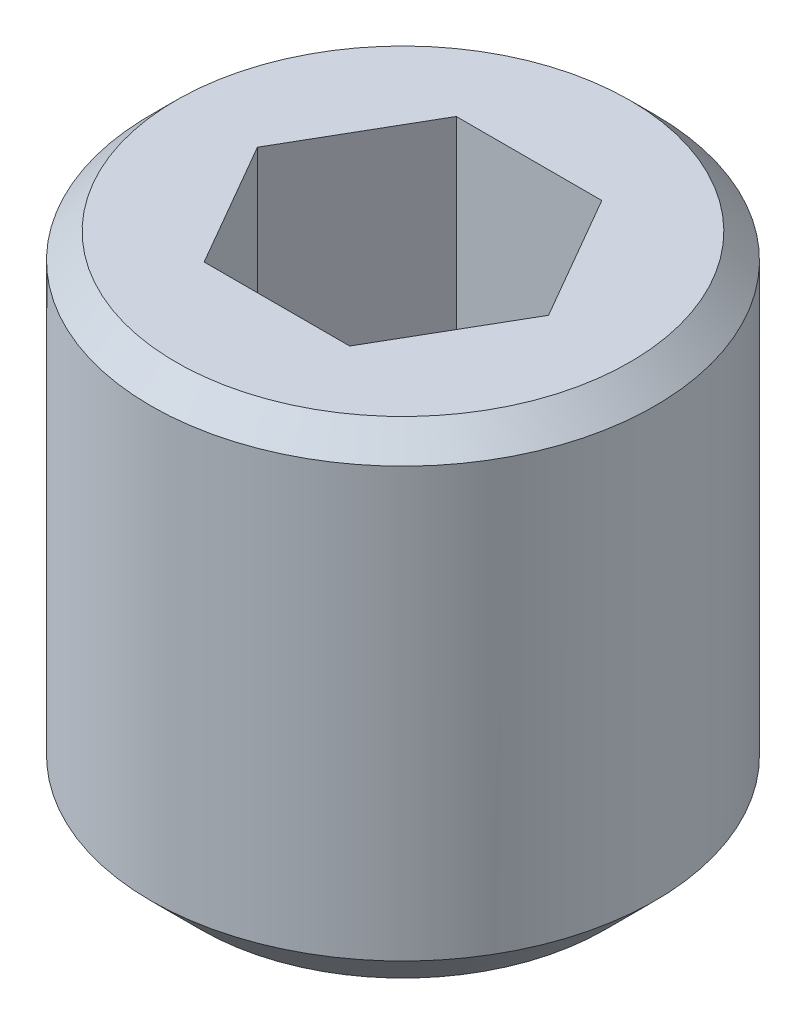
ISO-10303-21;
HEADER;
FILE_DESCRIPTION(('STEP AP214'),'2;1');
FILE_NAME('part.step','',(''),(''),'','','');
FILE_SCHEMA(('AUTOMOTIVE_DESIGN { 1 0 10303 214 1 1 1 1 }'));
ENDSEC;
DATA;
#1=APPLICATION_CONTEXT('core data for automotive mechanical design processes');
#2=APPLICATION_PROTOCOL_DEFINITION('international standard','automotive_design',2000,#1);
#3=PRODUCT_CONTEXT('',#1,'mechanical');
#4=PRODUCT('Part','Part','',(#3));
#5=PRODUCT_RELATED_PRODUCT_CATEGORY('part','',(#4));
#6=PRODUCT_DEFINITION_FORMATION('','',#4);
#7=PRODUCT_DEFINITION_CONTEXT('part definition',#1,'design');
#8=PRODUCT_DEFINITION('design','',#6,#7);
#9=PRODUCT_DEFINITION_SHAPE('','',#8);
#10=(LENGTH_UNIT() NAMED_UNIT(*) SI_UNIT(.MILLI.,.METRE.));
#11=(NAMED_UNIT(*) PLANE_ANGLE_UNIT() SI_UNIT($,.RADIAN.));
#12=(NAMED_UNIT(*) SI_UNIT($,.STERADIAN.) SOLID_ANGLE_UNIT());
#13=UNCERTAINTY_MEASURE_WITH_UNIT(LENGTH_MEASURE(1.E-05),#10,'distance_accuracy_value','');
#14=(GEOMETRIC_REPRESENTATION_CONTEXT(3) GLOBAL_UNCERTAINTY_ASSIGNED_CONTEXT((#13)) GLOBAL_UNIT_ASSIGNED_CONTEXT((#10,
#11,#12)) REPRESENTATION_CONTEXT('',''));
#15=CARTESIAN_POINT('',(0.,0.,0.));
#16=DIRECTION('',(0.,0.,1.));
#17=DIRECTION('',(1.,0.,0.));
#18=AXIS2_PLACEMENT_3D('',#15,#16,#17);
#19=CARTESIAN_POINT('',(0.,0.,0.));
#20=DIRECTION('',(0.,-1.,0.));
#21=DIRECTION('',(0.,0.,-1.));
#22=AXIS2_PLACEMENT_3D('',#19,#20,#21);
#23=PLANE('',#22);
#24=CARTESIAN_POINT('',(0.,0.,0.));
#25=DIRECTION('',(0.,-1.,0.));
#26=DIRECTION('',(0.,0.,-1.));
#27=AXIS2_PLACEMENT_3D('',#24,#25,#26);
#28=CIRCLE('',#27,1.35);
#29=CARTESIAN_POINT('',(0.,0.,-1.35));
#30=VERTEX_POINT('',#29);
#31=EDGE_CURVE('E45',#30,#30,#28,.F.);
#32=ORIENTED_EDGE('',*,*,#31,.T.);
#33=EDGE_LOOP('',(#32));
#34=FACE_BOUND('',#33,.T.);
#35=DIRECTION('',(-0.5,0.,0.866025403784439));
#36=VECTOR('',#35,1.);
#37=CARTESIAN_POINT('',(-0.43301270189222,0.,-0.75));
#38=LINE('',#37,#36);
#39=CARTESIAN_POINT('',(-0.43301270189222,0.,-0.75));
#40=VERTEX_POINT('',#39);
#41=CARTESIAN_POINT('',(-0.866025403784439,0.,0.));
#42=VERTEX_POINT('',#41);
#43=EDGE_CURVE('E126',#40,#42,#38,.T.);
#44=ORIENTED_EDGE('',*,*,#43,.F.);
#45=DIRECTION('',(-1.,0.,0.));
#46=VECTOR('',#45,1.);
#47=CARTESIAN_POINT('',(0.43301270189222,0.,-0.75));
#48=LINE('',#47,#46);
#49=CARTESIAN_POINT('',(0.43301270189222,0.,-0.75));
#50=VERTEX_POINT('',#49);
#51=EDGE_CURVE('E52',#50,#40,#48,.T.);
#52=ORIENTED_EDGE('',*,*,#51,.F.);
#53=DIRECTION('',(-0.5,0.,-0.866025403784439));
#54=VECTOR('',#53,1.);
#55=CARTESIAN_POINT('',(0.866025403784439,0.,0.));
#56=LINE('',#55,#54);
#57=CARTESIAN_POINT('',(0.866025403784439,0.,0.));
#58=VERTEX_POINT('',#57);
#59=EDGE_CURVE('E135',#58,#50,#56,.T.);
#60=ORIENTED_EDGE('',*,*,#59,.F.);
#61=DIRECTION('',(0.5,0.,-0.866025403784439));
#62=VECTOR('',#61,1.);
#63=CARTESIAN_POINT('',(0.43301270189222,0.,0.75));
#64=LINE('',#63,#62);
#65=CARTESIAN_POINT('',(0.43301270189222,0.,0.75));
#66=VERTEX_POINT('',#65);
#67=EDGE_CURVE('E133',#66,#58,#64,.T.);
#68=ORIENTED_EDGE('',*,*,#67,.F.);
#69=DIRECTION('',(1.,0.,0.));
#70=VECTOR('',#69,1.);
#71=CARTESIAN_POINT('',(-0.433012701892219,0.,0.750000000000001));
#72=LINE('',#71,#70);
#73=CARTESIAN_POINT('',(-0.433012701892219,0.,0.750000000000001));
#74=VERTEX_POINT('',#73);
#75=EDGE_CURVE('E100',#74,#66,#72,.T.);
#76=ORIENTED_EDGE('',*,*,#75,.F.);
#77=DIRECTION('',(0.5,0.,0.866025403784438));
#78=VECTOR('',#77,1.);
#79=CARTESIAN_POINT('',(-0.866025403784439,0.,0.));
#80=LINE('',#79,#78);
#81=EDGE_CURVE('E129',#42,#74,#80,.T.);
#82=ORIENTED_EDGE('',*,*,#81,.F.);
#83=EDGE_LOOP('',(#44,#52,#60,#68,#76,#82));
#84=FACE_BOUND('',#83,.T.);
#85=ADVANCED_FACE('F37',(#34,#84),#23,.F.);
#86=CARTESIAN_POINT('',(0.,0.,0.));
#87=DIRECTION('',(0.,1.,0.));
#88=DIRECTION('',(0.,0.,1.));
#89=AXIS2_PLACEMENT_3D('',#86,#87,#88);
#90=CYLINDRICAL_SURFACE('',#89,1.5);
#91=CARTESIAN_POINT('',(0.,-0.150000000000001,0.));
#92=DIRECTION('',(0.,-1.,0.));
#93=DIRECTION('',(0.,0.,-1.));
#94=AXIS2_PLACEMENT_3D('',#91,#92,#93);
#95=CIRCLE('',#94,1.5);
#96=CARTESIAN_POINT('',(0.,-0.150000000000001,-1.5));
#97=VERTEX_POINT('',#96);
#98=EDGE_CURVE('E11',#97,#97,#95,.T.);
#99=ORIENTED_EDGE('',*,*,#98,.T.);
#100=EDGE_LOOP('',(#99));
#101=FACE_BOUND('',#100,.T.);
#102=CARTESIAN_POINT('',(0.,-2.7,0.));
#103=DIRECTION('',(0.,1.,0.));
#104=DIRECTION('',(0.,0.,1.));
#105=AXIS2_PLACEMENT_3D('',#102,#103,#104);
#106=CIRCLE('',#105,1.5);
#107=CARTESIAN_POINT('',(0.,-2.7,1.5));
#108=VERTEX_POINT('',#107);
#109=EDGE_CURVE('E139',#108,#108,#106,.T.);
#110=ORIENTED_EDGE('',*,*,#109,.T.);
#111=EDGE_LOOP('',(#110));
#112=FACE_BOUND('',#111,.T.);
#113=ADVANCED_FACE('F163',(#101,#112),#90,.T.);
#114=CARTESIAN_POINT('',(1.5,-3.,0.));
#115=DIRECTION('',(0.,1.,0.));
#116=DIRECTION('',(0.,0.,1.));
#117=AXIS2_PLACEMENT_3D('',#114,#115,#116);
#118=PLANE('',#117);
#119=CARTESIAN_POINT('',(0.,-3.,0.));
#120=DIRECTION('',(0.,1.,0.));
#121=DIRECTION('',(0.,0.,1.));
#122=AXIS2_PLACEMENT_3D('',#119,#120,#121);
#123=CIRCLE('',#122,1.2);
#124=CARTESIAN_POINT('',(0.,-3.,1.2));
#125=VERTEX_POINT('',#124);
#126=EDGE_CURVE('E147',#125,#125,#123,.F.);
#127=ORIENTED_EDGE('',*,*,#126,.T.);
#128=EDGE_LOOP('',(#127));
#129=FACE_BOUND('',#128,.T.);
#130=ADVANCED_FACE('F168',(#129),#118,.F.);
#131=CARTESIAN_POINT('',(0.43301270189222,-1.5,-0.75));
#132=DIRECTION('',(0.,0.,-1.));
#133=DIRECTION('',(-1.,0.,0.));
#134=AXIS2_PLACEMENT_3D('',#131,#132,#133);
#135=PLANE('',#134);
#136=ORIENTED_EDGE('',*,*,#51,.T.);
#137=DIRECTION('',(0.,1.,0.));
#138=VECTOR('',#137,1.);
#139=CARTESIAN_POINT('',(-0.43301270189222,-1.5,-0.75));
#140=LINE('',#139,#138);
#141=CARTESIAN_POINT('',(-0.43301270189222,-1.5,-0.75));
#142=VERTEX_POINT('',#141);
#143=EDGE_CURVE('E82',#142,#40,#140,.T.);
#144=ORIENTED_EDGE('',*,*,#143,.F.);
#145=DIRECTION('',(-1.,0.,0.));
#146=VECTOR('',#145,1.);
#147=CARTESIAN_POINT('',(0.43301270189222,-1.5,-0.75));
#148=LINE('',#147,#146);
#149=CARTESIAN_POINT('',(0.43301270189222,-1.5,-0.75));
#150=VERTEX_POINT('',#149);
#151=EDGE_CURVE('E137',#150,#142,#148,.T.);
#152=ORIENTED_EDGE('',*,*,#151,.F.);
#153=DIRECTION('',(0.,1.,0.));
#154=VECTOR('',#153,1.);
#155=CARTESIAN_POINT('',(0.43301270189222,-1.5,-0.75));
#156=LINE('',#155,#154);
#157=EDGE_CURVE('E60',#150,#50,#156,.T.);
#158=ORIENTED_EDGE('',*,*,#157,.T.);
#159=EDGE_LOOP('',(#136,#144,#152,#158));
#160=FACE_BOUND('',#159,.T.);
#161=ADVANCED_FACE('F174',(#160),#135,.F.);
#162=CARTESIAN_POINT('',(0.866025403784439,-1.5,0.));
#163=DIRECTION('',(0.866025403784439,0.,-0.5));
#164=DIRECTION('',(-0.5,0.,-0.866025403784439));
#165=AXIS2_PLACEMENT_3D('',#162,#163,#164);
#166=PLANE('',#165);
#167=ORIENTED_EDGE('',*,*,#59,.T.);
#168=ORIENTED_EDGE('',*,*,#157,.F.);
#169=DIRECTION('',(-0.5,0.,-0.866025403784439));
#170=VECTOR('',#169,1.);
#171=CARTESIAN_POINT('',(0.866025403784439,-1.5,0.));
#172=LINE('',#171,#170);
#173=CARTESIAN_POINT('',(0.866025403784439,-1.5,0.));
#174=VERTEX_POINT('',#173);
#175=EDGE_CURVE('E112',#174,#150,#172,.T.);
#176=ORIENTED_EDGE('',*,*,#175,.F.);
#177=DIRECTION('',(0.,1.,0.));
#178=VECTOR('',#177,1.);
#179=CARTESIAN_POINT('',(0.866025403784439,-1.5,0.));
#180=LINE('',#179,#178);
#181=EDGE_CURVE('E104',#174,#58,#180,.T.);
#182=ORIENTED_EDGE('',*,*,#181,.T.);
#183=EDGE_LOOP('',(#167,#168,#176,#182));
#184=FACE_BOUND('',#183,.T.);
#185=ADVANCED_FACE('F178',(#184),#166,.F.);
#186=CARTESIAN_POINT('',(0.43301270189222,-1.5,0.75));
#187=DIRECTION('',(0.866025403784439,0.,0.5));
#188=DIRECTION('',(0.5,0.,-0.866025403784439));
#189=AXIS2_PLACEMENT_3D('',#186,#187,#188);
#190=PLANE('',#189);
#191=ORIENTED_EDGE('',*,*,#67,.T.);
#192=ORIENTED_EDGE('',*,*,#181,.F.);
#193=DIRECTION('',(0.5,0.,-0.866025403784439));
#194=VECTOR('',#193,1.);
#195=CARTESIAN_POINT('',(0.43301270189222,-1.5,0.75));
#196=LINE('',#195,#194);
#197=CARTESIAN_POINT('',(0.43301270189222,-1.5,0.75));
#198=VERTEX_POINT('',#197);
#199=EDGE_CURVE('E108',#198,#174,#196,.T.);
#200=ORIENTED_EDGE('',*,*,#199,.F.);
#201=DIRECTION('',(0.,1.,0.));
#202=VECTOR('',#201,1.);
#203=CARTESIAN_POINT('',(0.43301270189222,-1.5,0.75));
#204=LINE('',#203,#202);
#205=EDGE_CURVE('E93',#198,#66,#204,.T.);
#206=ORIENTED_EDGE('',*,*,#205,.T.);
#207=EDGE_LOOP('',(#191,#192,#200,#206));
#208=FACE_BOUND('',#207,.T.);
#209=ADVANCED_FACE('F109',(#208),#190,.F.);
#210=CARTESIAN_POINT('',(-0.433012701892219,-1.5,0.750000000000001));
#211=DIRECTION('',(0.,0.,1.));
#212=DIRECTION('',(1.,0.,0.));
#213=AXIS2_PLACEMENT_3D('',#210,#211,#212);
#214=PLANE('',#213);
#215=ORIENTED_EDGE('',*,*,#75,.T.);
#216=ORIENTED_EDGE('',*,*,#205,.F.);
#217=DIRECTION('',(1.,0.,0.));
#218=VECTOR('',#217,1.);
#219=CARTESIAN_POINT('',(-0.433012701892219,-1.5,0.750000000000001));
#220=LINE('',#219,#218);
#221=CARTESIAN_POINT('',(-0.433012701892219,-1.5,0.750000000000001));
#222=VERTEX_POINT('',#221);
#223=EDGE_CURVE('E97',#222,#198,#220,.T.);
#224=ORIENTED_EDGE('',*,*,#223,.F.);
#225=DIRECTION('',(0.,1.,0.));
#226=VECTOR('',#225,1.);
#227=CARTESIAN_POINT('',(-0.433012701892219,-1.5,0.750000000000001));
#228=LINE('',#227,#226);
#229=EDGE_CURVE('E105',#222,#74,#228,.T.);
#230=ORIENTED_EDGE('',*,*,#229,.T.);
#231=EDGE_LOOP('',(#215,#216,#224,#230));
#232=FACE_BOUND('',#231,.T.);
#233=ADVANCED_FACE('F95',(#232),#214,.F.);
#234=CARTESIAN_POINT('',(-0.866025403784439,-1.5,0.));
#235=DIRECTION('',(-0.866025403784438,0.,0.5));
#236=DIRECTION('',(0.5,0.,0.866025403784438));
#237=AXIS2_PLACEMENT_3D('',#234,#235,#236);
#238=PLANE('',#237);
#239=ORIENTED_EDGE('',*,*,#81,.T.);
#240=ORIENTED_EDGE('',*,*,#229,.F.);
#241=DIRECTION('',(0.5,0.,0.866025403784438));
#242=VECTOR('',#241,1.);
#243=CARTESIAN_POINT('',(-0.866025403784439,-1.5,0.));
#244=LINE('',#243,#242);
#245=CARTESIAN_POINT('',(-0.866025403784439,-1.5,0.));
#246=VERTEX_POINT('',#245);
#247=EDGE_CURVE('E118',#246,#222,#244,.T.);
#248=ORIENTED_EDGE('',*,*,#247,.F.);
#249=DIRECTION('',(0.,1.,0.));
#250=VECTOR('',#249,1.);
#251=CARTESIAN_POINT('',(-0.866025403784439,-1.5,0.));
#252=LINE('',#251,#250);
#253=EDGE_CURVE('E142',#246,#42,#252,.T.);
#254=ORIENTED_EDGE('',*,*,#253,.T.);
#255=EDGE_LOOP('',(#239,#240,#248,#254));
#256=FACE_BOUND('',#255,.T.);
#257=ADVANCED_FACE('F182',(#256),#238,.F.);
#258=CARTESIAN_POINT('',(-0.43301270189222,-1.5,-0.75));
#259=DIRECTION('',(-0.866025403784439,0.,-0.5));
#260=DIRECTION('',(-0.5,0.,0.866025403784439));
#261=AXIS2_PLACEMENT_3D('',#258,#259,#260);
#262=PLANE('',#261);
#263=ORIENTED_EDGE('',*,*,#43,.T.);
#264=ORIENTED_EDGE('',*,*,#253,.F.);
#265=DIRECTION('',(-0.5,0.,0.866025403784439));
#266=VECTOR('',#265,1.);
#267=CARTESIAN_POINT('',(-0.43301270189222,-1.5,-0.75));
#268=LINE('',#267,#266);
#269=EDGE_CURVE('E120',#142,#246,#268,.T.);
#270=ORIENTED_EDGE('',*,*,#269,.F.);
#271=ORIENTED_EDGE('',*,*,#143,.T.);
#272=EDGE_LOOP('',(#263,#264,#270,#271));
#273=FACE_BOUND('',#272,.T.);
#274=ADVANCED_FACE('F179',(#273),#262,.F.);
#275=CARTESIAN_POINT('',(-0.43301270189222,-1.5,-0.75));
#276=DIRECTION('',(0.,1.,0.));
#277=DIRECTION('',(0.,0.,1.));
#278=AXIS2_PLACEMENT_3D('',#275,#276,#277);
#279=PLANE('',#278);
#280=ORIENTED_EDGE('',*,*,#151,.T.);
#281=ORIENTED_EDGE('',*,*,#269,.T.);
#282=ORIENTED_EDGE('',*,*,#247,.T.);
#283=ORIENTED_EDGE('',*,*,#223,.T.);
#284=ORIENTED_EDGE('',*,*,#199,.T.);
#285=ORIENTED_EDGE('',*,*,#175,.T.);
#286=EDGE_LOOP('',(#280,#281,#282,#283,#284,#285));
#287=FACE_BOUND('',#286,.T.);
#288=ADVANCED_FACE('F115',(#287),#279,.T.);
#289=CARTESIAN_POINT('',(0.,-2.7,0.));
#290=DIRECTION('',(0.,1.,0.));
#291=DIRECTION('',(0.,0.,1.));
#292=AXIS2_PLACEMENT_3D('',#289,#290,#291);
#293=CONICAL_SURFACE('',#292,1.5,0.78539816339745);
#294=ORIENTED_EDGE('',*,*,#126,.F.);
#295=EDGE_LOOP('',(#294));
#296=FACE_BOUND('',#295,.T.);
#297=ORIENTED_EDGE('',*,*,#109,.F.);
#298=EDGE_LOOP('',(#297));
#299=FACE_BOUND('',#298,.T.);
#300=ADVANCED_FACE('F155',(#296,#299),#293,.T.);
#301=CARTESIAN_POINT('',(0.,0.,0.));
#302=DIRECTION('',(0.,-1.,0.));
#303=DIRECTION('',(0.,0.,-1.));
#304=AXIS2_PLACEMENT_3D('',#301,#302,#303);
#305=CONICAL_SURFACE('',#304,1.35,0.785398163397448);
#306=ORIENTED_EDGE('',*,*,#98,.F.);
#307=EDGE_LOOP('',(#306));
#308=FACE_BOUND('',#307,.T.);
#309=ORIENTED_EDGE('',*,*,#31,.F.);
#310=EDGE_LOOP('',(#309));
#311=FACE_BOUND('',#310,.T.);
#312=ADVANCED_FACE('F39',(#308,#311),#305,.T.);
#313=CLOSED_SHELL('',(#85,#113,#130,#161,#185,#209,#233,#257,#274,#288,#300,#312));
#314=MANIFOLD_SOLID_BREP('B2',#313);
#315=ADVANCED_BREP_SHAPE_REPRESENTATION('',(#18,#314),#14);
#316=SHAPE_DEFINITION_REPRESENTATION(#9,#315);
ENDSEC;
END-ISO-10303-21;
